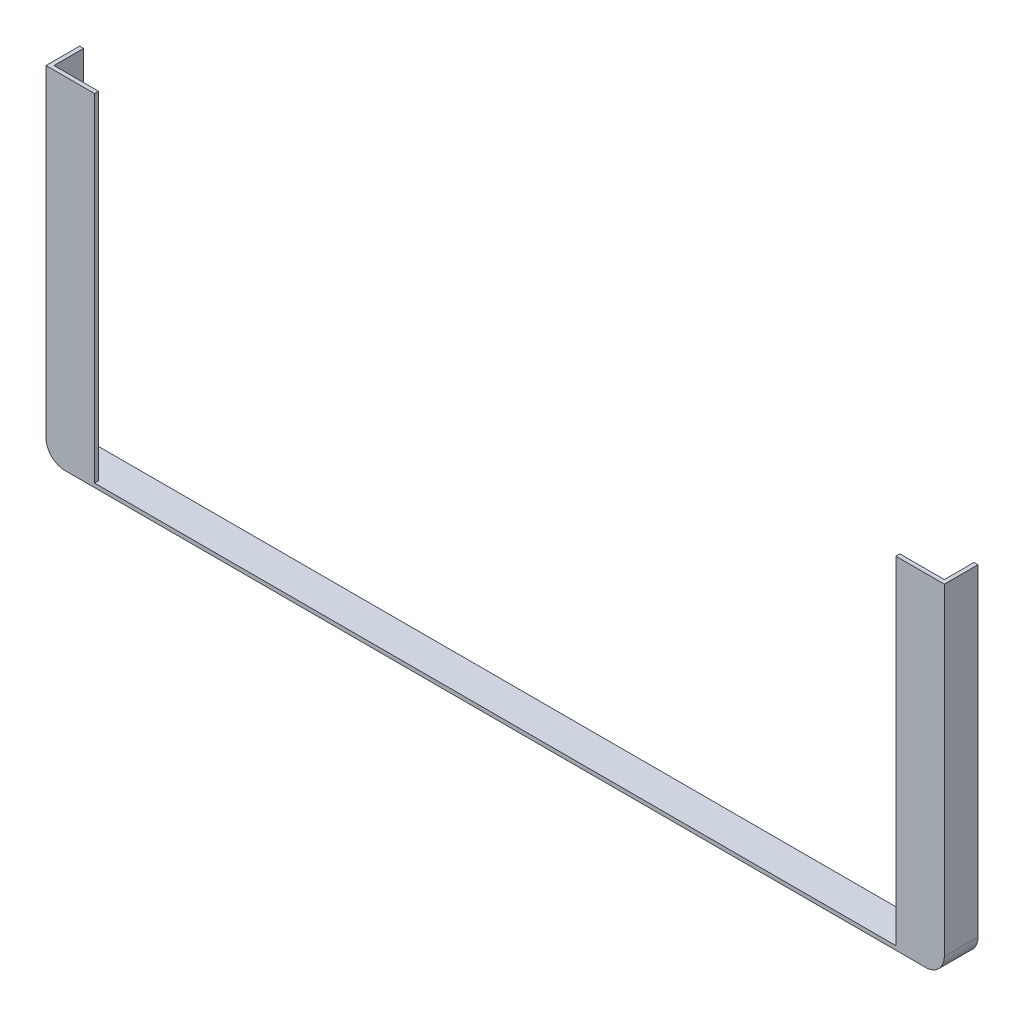
ISO-10303-21;
HEADER;
FILE_DESCRIPTION(('STEP AP214'),'2;1');
FILE_NAME('part.step','',(''),(''),'','','');
FILE_SCHEMA(('AUTOMOTIVE_DESIGN { 1 0 10303 214 1 1 1 1 }'));
ENDSEC;
DATA;
#1=APPLICATION_CONTEXT('core data for automotive mechanical design processes');
#2=APPLICATION_PROTOCOL_DEFINITION('international standard','automotive_design',2000,#1);
#3=PRODUCT_CONTEXT('',#1,'mechanical');
#4=PRODUCT('Part','Part','',(#3));
#5=PRODUCT_RELATED_PRODUCT_CATEGORY('part','',(#4));
#6=PRODUCT_DEFINITION_FORMATION('','',#4);
#7=PRODUCT_DEFINITION_CONTEXT('part definition',#1,'design');
#8=PRODUCT_DEFINITION('design','',#6,#7);
#9=PRODUCT_DEFINITION_SHAPE('','',#8);
#10=(LENGTH_UNIT() NAMED_UNIT(*) SI_UNIT(.MILLI.,.METRE.));
#11=(NAMED_UNIT(*) PLANE_ANGLE_UNIT() SI_UNIT($,.RADIAN.));
#12=(NAMED_UNIT(*) SI_UNIT($,.STERADIAN.) SOLID_ANGLE_UNIT());
#13=UNCERTAINTY_MEASURE_WITH_UNIT(LENGTH_MEASURE(1.E-05),#10,'distance_accuracy_value','');
#14=(GEOMETRIC_REPRESENTATION_CONTEXT(3) GLOBAL_UNCERTAINTY_ASSIGNED_CONTEXT((#13)) GLOBAL_UNIT_ASSIGNED_CONTEXT((#10,
#11,#12)) REPRESENTATION_CONTEXT('',''));
#15=CARTESIAN_POINT('',(0.,0.,0.));
#16=DIRECTION('',(0.,0.,1.));
#17=DIRECTION('',(1.,0.,0.));
#18=AXIS2_PLACEMENT_3D('',#15,#16,#17);
#19=CARTESIAN_POINT('',(381.,288.6837,-25.4));
#20=DIRECTION('',(0.,1.,0.));
#21=DIRECTION('',(0.,0.,1.));
#22=AXIS2_PLACEMENT_3D('',#19,#20,#21);
#23=PLANE('',#22);
#24=DIRECTION('',(0.,0.,-1.));
#25=VECTOR('',#24,1.);
#26=CARTESIAN_POINT('',(342.9,288.6837,3.4173));
#27=LINE('',#26,#25);
#28=CARTESIAN_POINT('',(342.9,288.6837,3.4163));
#29=VERTEX_POINT('',#28);
#30=CARTESIAN_POINT('',(342.9,288.6837,0.));
#31=VERTEX_POINT('',#30);
#32=EDGE_CURVE('E312',#29,#31,#27,.T.);
#33=ORIENTED_EDGE('',*,*,#32,.F.);
#34=DIRECTION('',(-1.,0.,0.));
#35=VECTOR('',#34,1.);
#36=CARTESIAN_POINT('',(384.4163,288.6837,3.4163));
#37=LINE('',#36,#35);
#38=CARTESIAN_POINT('',(384.4163,288.6837,3.4163));
#39=VERTEX_POINT('',#38);
#40=EDGE_CURVE('E269',#39,#29,#37,.T.);
#41=ORIENTED_EDGE('',*,*,#40,.F.);
#42=DIRECTION('',(0.,0.,1.));
#43=VECTOR('',#42,1.);
#44=CARTESIAN_POINT('',(384.4163,288.6837,-25.4));
#45=LINE('',#44,#43);
#46=CARTESIAN_POINT('',(384.4163,288.6837,-25.4));
#47=VERTEX_POINT('',#46);
#48=EDGE_CURVE('E172',#47,#39,#45,.T.);
#49=ORIENTED_EDGE('',*,*,#48,.F.);
#50=DIRECTION('',(-1.,0.,0.));
#51=VECTOR('',#50,1.);
#52=CARTESIAN_POINT('',(381.,288.6837,-25.4));
#53=LINE('',#52,#51);
#54=CARTESIAN_POINT('',(381.,288.6837,-25.4));
#55=VERTEX_POINT('',#54);
#56=EDGE_CURVE('E142',#47,#55,#53,.T.);
#57=ORIENTED_EDGE('',*,*,#56,.T.);
#58=DIRECTION('',(0.,0.,1.));
#59=VECTOR('',#58,1.);
#60=CARTESIAN_POINT('',(381.,288.6837,-25.4));
#61=LINE('',#60,#59);
#62=CARTESIAN_POINT('',(381.,288.6837,0.));
#63=VERTEX_POINT('',#62);
#64=EDGE_CURVE('E130',#55,#63,#61,.T.);
#65=ORIENTED_EDGE('',*,*,#64,.T.);
#66=DIRECTION('',(-1.,0.,0.));
#67=VECTOR('',#66,1.);
#68=CARTESIAN_POINT('',(384.4163,288.6837,0.));
#69=LINE('',#68,#67);
#70=EDGE_CURVE('E205',#63,#31,#69,.T.);
#71=ORIENTED_EDGE('',*,*,#70,.T.);
#72=EDGE_LOOP('',(#33,#41,#49,#57,#65,#71));
#73=FACE_BOUND('',#72,.T.);
#74=ADVANCED_FACE('F34',(#73),#23,.T.);
#75=CARTESIAN_POINT('',(-368.3,12.7,0.));
#76=DIRECTION('',(0.,0.,1.));
#77=DIRECTION('',(1.,0.,0.));
#78=AXIS2_PLACEMENT_3D('',#75,#76,#77);
#79=PLANE('',#78);
#80=DIRECTION('',(-1.,0.,0.));
#81=VECTOR('',#80,1.);
#82=CARTESIAN_POINT('',(-368.3,0.,0.));
#83=LINE('',#82,#81);
#84=CARTESIAN_POINT('',(368.3,1.35308431126191E-13,0.));
#85=VERTEX_POINT('',#84);
#86=CARTESIAN_POINT('',(342.9,1.35308431126191E-13,0.));
#87=VERTEX_POINT('',#86);
#88=EDGE_CURVE('E190',#85,#87,#83,.T.);
#89=ORIENTED_EDGE('',*,*,#88,.T.);
#90=DIRECTION('',(0.,-1.,0.));
#91=VECTOR('',#90,1.);
#92=CARTESIAN_POINT('',(342.9,1.35308431126191E-13,0.));
#93=LINE('',#92,#91);
#94=EDGE_CURVE('E208',#31,#87,#93,.T.);
#95=ORIENTED_EDGE('',*,*,#94,.F.);
#96=ORIENTED_EDGE('',*,*,#70,.F.);
#97=DIRECTION('',(0.,-1.,0.));
#98=VECTOR('',#97,1.);
#99=CARTESIAN_POINT('',(381.,12.7000000000002,0.));
#100=LINE('',#99,#98);
#101=CARTESIAN_POINT('',(381.,12.7000000000002,0.));
#102=VERTEX_POINT('',#101);
#103=EDGE_CURVE('E159',#63,#102,#100,.T.);
#104=ORIENTED_EDGE('',*,*,#103,.T.);
#105=CARTESIAN_POINT('',(368.3,12.7000000000002,0.));
#106=DIRECTION('',(0.,0.,-1.));
#107=DIRECTION('',(1.,0.,0.));
#108=AXIS2_PLACEMENT_3D('',#105,#106,#107);
#109=CIRCLE('',#108,12.7);
#110=EDGE_CURVE('E125',#102,#85,#109,.T.);
#111=ORIENTED_EDGE('',*,*,#110,.T.);
#112=EDGE_LOOP('',(#89,#95,#96,#104,#111));
#113=FACE_BOUND('',#112,.T.);
#114=ADVANCED_FACE('F202',(#113),#79,.F.);
#115=CARTESIAN_POINT('',(-368.3,12.7,-25.4));
#116=DIRECTION('',(0.,0.,1.));
#117=DIRECTION('',(1.,0.,0.));
#118=AXIS2_PLACEMENT_3D('',#115,#116,#117);
#119=CYLINDRICAL_SURFACE('',#118,12.7);
#120=CARTESIAN_POINT('',(-368.3,12.7,0.));
#121=DIRECTION('',(0.,0.,-1.));
#122=DIRECTION('',(1.,0.,0.));
#123=AXIS2_PLACEMENT_3D('',#120,#121,#122);
#124=CIRCLE('',#123,12.7);
#125=CARTESIAN_POINT('',(-368.3,0.,0.));
#126=VERTEX_POINT('',#125);
#127=CARTESIAN_POINT('',(-381.,12.7,0.));
#128=VERTEX_POINT('',#127);
#129=EDGE_CURVE('E149',#126,#128,#124,.T.);
#130=ORIENTED_EDGE('',*,*,#129,.F.);
#131=DIRECTION('',(0.,0.,1.));
#132=VECTOR('',#131,1.);
#133=CARTESIAN_POINT('',(-368.3,0.,-25.4));
#134=LINE('',#133,#132);
#135=CARTESIAN_POINT('',(-368.3,0.,-25.4));
#136=VERTEX_POINT('',#135);
#137=EDGE_CURVE('E11',#136,#126,#134,.T.);
#138=ORIENTED_EDGE('',*,*,#137,.F.);
#139=CARTESIAN_POINT('',(-368.3,12.7,-25.4));
#140=DIRECTION('',(0.,0.,-1.));
#141=DIRECTION('',(1.,0.,0.));
#142=AXIS2_PLACEMENT_3D('',#139,#140,#141);
#143=CIRCLE('',#142,12.7);
#144=CARTESIAN_POINT('',(-381.,12.7,-25.4));
#145=VERTEX_POINT('',#144);
#146=EDGE_CURVE('E192',#136,#145,#143,.T.);
#147=ORIENTED_EDGE('',*,*,#146,.T.);
#148=DIRECTION('',(0.,0.,1.));
#149=VECTOR('',#148,1.);
#150=CARTESIAN_POINT('',(-381.,12.7,-25.4));
#151=LINE('',#150,#149);
#152=EDGE_CURVE('E91',#145,#128,#151,.T.);
#153=ORIENTED_EDGE('',*,*,#152,.T.);
#154=EDGE_LOOP('',(#130,#138,#147,#153));
#155=FACE_BOUND('',#154,.T.);
#156=ADVANCED_FACE('F36',(#155),#119,.F.);
#157=CARTESIAN_POINT('',(-368.3,0.,-25.4));
#158=DIRECTION('',(0.,1.,0.));
#159=DIRECTION('',(-1.,0.,0.));
#160=AXIS2_PLACEMENT_3D('',#157,#158,#159);
#161=PLANE('',#160);
#162=ORIENTED_EDGE('',*,*,#88,.F.);
#163=DIRECTION('',(0.,0.,1.));
#164=VECTOR('',#163,1.);
#165=CARTESIAN_POINT('',(368.3,1.35308431126191E-13,-25.4));
#166=LINE('',#165,#164);
#167=CARTESIAN_POINT('',(368.3,1.35308431126191E-13,-25.4));
#168=VERTEX_POINT('',#167);
#169=EDGE_CURVE('E44',#168,#85,#166,.T.);
#170=ORIENTED_EDGE('',*,*,#169,.F.);
#171=DIRECTION('',(-1.,0.,0.));
#172=VECTOR('',#171,1.);
#173=CARTESIAN_POINT('',(-368.3,0.,-25.4));
#174=LINE('',#173,#172);
#175=EDGE_CURVE('E139',#168,#136,#174,.T.);
#176=ORIENTED_EDGE('',*,*,#175,.T.);
#177=ORIENTED_EDGE('',*,*,#137,.T.);
#178=CARTESIAN_POINT('',(-342.9,1.35308431126191E-13,0.));
#179=VERTEX_POINT('',#178);
#180=EDGE_CURVE('E193',#179,#126,#83,.T.);
#181=ORIENTED_EDGE('',*,*,#180,.F.);
#182=DIRECTION('',(0.,0.,-1.));
#183=VECTOR('',#182,1.);
#184=CARTESIAN_POINT('',(-342.9,1.35308431126191E-13,3.4173));
#185=LINE('',#184,#183);
#186=CARTESIAN_POINT('',(-342.9,1.35308431126191E-13,3.4163));
#187=VERTEX_POINT('',#186);
#188=EDGE_CURVE('E52',#187,#179,#185,.T.);
#189=ORIENTED_EDGE('',*,*,#188,.F.);
#190=DIRECTION('',(-1.,0.,0.));
#191=VECTOR('',#190,1.);
#192=CARTESIAN_POINT('',(342.9,1.35308431126191E-13,3.4163));
#193=LINE('',#192,#191);
#194=CARTESIAN_POINT('',(342.9,1.35308431126191E-13,3.4163));
#195=VERTEX_POINT('',#194);
#196=EDGE_CURVE('E216',#195,#187,#193,.T.);
#197=ORIENTED_EDGE('',*,*,#196,.F.);
#198=DIRECTION('',(0.,0.,-1.));
#199=VECTOR('',#198,1.);
#200=CARTESIAN_POINT('',(342.9,1.35308431126191E-13,3.4173));
#201=LINE('',#200,#199);
#202=EDGE_CURVE('E313',#195,#87,#201,.T.);
#203=ORIENTED_EDGE('',*,*,#202,.T.);
#204=EDGE_LOOP('',(#162,#170,#176,#177,#181,#189,#197,#203));
#205=FACE_BOUND('',#204,.T.);
#206=ADVANCED_FACE('F332',(#205),#161,.T.);
#207=CARTESIAN_POINT('',(368.3,12.7000000000002,-25.4));
#208=DIRECTION('',(0.,0.,1.));
#209=DIRECTION('',(1.,0.,0.));
#210=AXIS2_PLACEMENT_3D('',#207,#208,#209);
#211=CYLINDRICAL_SURFACE('',#210,12.7);
#212=ORIENTED_EDGE('',*,*,#110,.F.);
#213=DIRECTION('',(0.,0.,1.));
#214=VECTOR('',#213,1.);
#215=CARTESIAN_POINT('',(381.,12.7000000000002,-25.4));
#216=LINE('',#215,#214);
#217=CARTESIAN_POINT('',(381.,12.7000000000002,-25.4));
#218=VERTEX_POINT('',#217);
#219=EDGE_CURVE('E119',#218,#102,#216,.T.);
#220=ORIENTED_EDGE('',*,*,#219,.F.);
#221=CARTESIAN_POINT('',(368.3,12.7000000000002,-25.4));
#222=DIRECTION('',(0.,0.,-1.));
#223=DIRECTION('',(1.,0.,0.));
#224=AXIS2_PLACEMENT_3D('',#221,#222,#223);
#225=CIRCLE('',#224,12.7);
#226=EDGE_CURVE('E122',#218,#168,#225,.T.);
#227=ORIENTED_EDGE('',*,*,#226,.T.);
#228=ORIENTED_EDGE('',*,*,#169,.T.);
#229=EDGE_LOOP('',(#212,#220,#227,#228));
#230=FACE_BOUND('',#229,.T.);
#231=ADVANCED_FACE('F121',(#230),#211,.F.);
#232=CARTESIAN_POINT('',(381.,12.7000000000002,-25.4));
#233=DIRECTION('',(-1.,0.,0.));
#234=DIRECTION('',(0.,-1.,0.));
#235=AXIS2_PLACEMENT_3D('',#232,#233,#234);
#236=PLANE('',#235);
#237=ORIENTED_EDGE('',*,*,#103,.F.);
#238=ORIENTED_EDGE('',*,*,#64,.F.);
#239=DIRECTION('',(0.,-1.,0.));
#240=VECTOR('',#239,1.);
#241=CARTESIAN_POINT('',(381.,12.7000000000002,-25.4));
#242=LINE('',#241,#240);
#243=EDGE_CURVE('E136',#55,#218,#242,.T.);
#244=ORIENTED_EDGE('',*,*,#243,.T.);
#245=ORIENTED_EDGE('',*,*,#219,.T.);
#246=EDGE_LOOP('',(#237,#238,#244,#245));
#247=FACE_BOUND('',#246,.T.);
#248=ADVANCED_FACE('F141',(#247),#236,.T.);
#249=DIRECTION('',(0.,0.,-1.));
#250=VECTOR('',#249,1.);
#251=CARTESIAN_POINT('',(-342.9,288.6837,3.4173));
#252=LINE('',#251,#250);
#253=CARTESIAN_POINT('',(-342.9,288.6837,3.4163));
#254=VERTEX_POINT('',#253);
#255=CARTESIAN_POINT('',(-342.9,288.6837,0.));
#256=VERTEX_POINT('',#255);
#257=EDGE_CURVE('E318',#254,#256,#252,.T.);
#258=ORIENTED_EDGE('',*,*,#257,.T.);
#259=CARTESIAN_POINT('',(-381.,288.6837,0.));
#260=VERTEX_POINT('',#259);
#261=EDGE_CURVE('E38',#256,#260,#69,.T.);
#262=ORIENTED_EDGE('',*,*,#261,.T.);
#263=DIRECTION('',(0.,0.,1.));
#264=VECTOR('',#263,1.);
#265=CARTESIAN_POINT('',(-381.,288.6837,-25.4));
#266=LINE('',#265,#264);
#267=CARTESIAN_POINT('',(-381.,288.6837,-25.4));
#268=VERTEX_POINT('',#267);
#269=EDGE_CURVE('E162',#268,#260,#266,.T.);
#270=ORIENTED_EDGE('',*,*,#269,.F.);
#271=DIRECTION('',(-1.,0.,0.));
#272=VECTOR('',#271,1.);
#273=CARTESIAN_POINT('',(-384.4163,288.6837,-25.4));
#274=LINE('',#273,#272);
#275=CARTESIAN_POINT('',(-384.4163,288.6837,-25.4));
#276=VERTEX_POINT('',#275);
#277=EDGE_CURVE('E221',#268,#276,#274,.T.);
#278=ORIENTED_EDGE('',*,*,#277,.T.);
#279=DIRECTION('',(0.,0.,1.));
#280=VECTOR('',#279,1.);
#281=CARTESIAN_POINT('',(-384.4163,288.6837,-25.4));
#282=LINE('',#281,#280);
#283=CARTESIAN_POINT('',(-384.4163,288.6837,3.4163));
#284=VERTEX_POINT('',#283);
#285=EDGE_CURVE('E165',#276,#284,#282,.T.);
#286=ORIENTED_EDGE('',*,*,#285,.T.);
#287=EDGE_CURVE('E268',#254,#284,#37,.T.);
#288=ORIENTED_EDGE('',*,*,#287,.F.);
#289=EDGE_LOOP('',(#258,#262,#270,#278,#286,#288));
#290=FACE_BOUND('',#289,.T.);
#291=ADVANCED_FACE('F287',(#290),#23,.T.);
#292=CARTESIAN_POINT('',(384.4163,12.7000000000002,-25.4));
#293=DIRECTION('',(1.,0.,0.));
#294=DIRECTION('',(0.,0.,-1.));
#295=AXIS2_PLACEMENT_3D('',#292,#293,#294);
#296=PLANE('',#295);
#297=ORIENTED_EDGE('',*,*,#48,.T.);
#298=DIRECTION('',(0.,1.,0.));
#299=VECTOR('',#298,1.);
#300=CARTESIAN_POINT('',(384.4163,12.7000000000002,3.4163));
#301=LINE('',#300,#299);
#302=CARTESIAN_POINT('',(384.4163,12.7000000000002,3.4163));
#303=VERTEX_POINT('',#302);
#304=EDGE_CURVE('E263',#303,#39,#301,.T.);
#305=ORIENTED_EDGE('',*,*,#304,.F.);
#306=DIRECTION('',(0.,0.,1.));
#307=VECTOR('',#306,1.);
#308=CARTESIAN_POINT('',(384.4163,12.7000000000002,-25.4));
#309=LINE('',#308,#307);
#310=CARTESIAN_POINT('',(384.4163,12.7000000000002,-25.4));
#311=VERTEX_POINT('',#310);
#312=EDGE_CURVE('E185',#311,#303,#309,.T.);
#313=ORIENTED_EDGE('',*,*,#312,.F.);
#314=DIRECTION('',(0.,1.,0.));
#315=VECTOR('',#314,1.);
#316=CARTESIAN_POINT('',(384.4163,12.7000000000002,-25.4));
#317=LINE('',#316,#315);
#318=EDGE_CURVE('E144',#311,#47,#317,.T.);
#319=ORIENTED_EDGE('',*,*,#318,.T.);
#320=EDGE_LOOP('',(#297,#305,#313,#319));
#321=FACE_BOUND('',#320,.T.);
#322=ADVANCED_FACE('F238',(#321),#296,.T.);
#323=CARTESIAN_POINT('',(368.3,12.7000000000002,-25.4));
#324=DIRECTION('',(0.,0.,1.));
#325=DIRECTION('',(1.,0.,0.));
#326=AXIS2_PLACEMENT_3D('',#323,#324,#325);
#327=CYLINDRICAL_SURFACE('',#326,16.1163);
#328=ORIENTED_EDGE('',*,*,#312,.T.);
#329=CARTESIAN_POINT('',(368.3,12.7000000000002,3.4163));
#330=DIRECTION('',(0.,0.,1.));
#331=DIRECTION('',(1.,0.,0.));
#332=AXIS2_PLACEMENT_3D('',#329,#330,#331);
#333=CIRCLE('',#332,16.1163);
#334=CARTESIAN_POINT('',(368.3,-3.41629999999987,3.4163));
#335=VERTEX_POINT('',#334);
#336=EDGE_CURVE('E250',#335,#303,#333,.T.);
#337=ORIENTED_EDGE('',*,*,#336,.F.);
#338=DIRECTION('',(0.,0.,1.));
#339=VECTOR('',#338,1.);
#340=CARTESIAN_POINT('',(368.3,-3.41629999999987,-25.4));
#341=LINE('',#340,#339);
#342=CARTESIAN_POINT('',(368.3,-3.41629999999987,-25.4));
#343=VERTEX_POINT('',#342);
#344=EDGE_CURVE('E182',#343,#335,#341,.T.);
#345=ORIENTED_EDGE('',*,*,#344,.F.);
#346=CARTESIAN_POINT('',(368.3,12.7000000000002,-25.4));
#347=DIRECTION('',(0.,0.,1.));
#348=DIRECTION('',(1.,0.,0.));
#349=AXIS2_PLACEMENT_3D('',#346,#347,#348);
#350=CIRCLE('',#349,16.1163);
#351=EDGE_CURVE('E233',#343,#311,#350,.T.);
#352=ORIENTED_EDGE('',*,*,#351,.T.);
#353=EDGE_LOOP('',(#328,#337,#345,#352));
#354=FACE_BOUND('',#353,.T.);
#355=ADVANCED_FACE('F245',(#354),#327,.T.);
#356=CARTESIAN_POINT('',(-368.3,-3.4163,-25.4));
#357=DIRECTION('',(0.,-1.,0.));
#358=DIRECTION('',(1.,0.,0.));
#359=AXIS2_PLACEMENT_3D('',#356,#357,#358);
#360=PLANE('',#359);
#361=ORIENTED_EDGE('',*,*,#344,.T.);
#362=DIRECTION('',(1.,0.,0.));
#363=VECTOR('',#362,1.);
#364=CARTESIAN_POINT('',(-368.3,-3.41629999999999,3.4163));
#365=LINE('',#364,#363);
#366=CARTESIAN_POINT('',(-368.3,-3.41629999999999,3.4163));
#367=VERTEX_POINT('',#366);
#368=EDGE_CURVE('E214',#367,#335,#365,.T.);
#369=ORIENTED_EDGE('',*,*,#368,.F.);
#370=DIRECTION('',(0.,0.,1.));
#371=VECTOR('',#370,1.);
#372=CARTESIAN_POINT('',(-368.3,-3.41629999999999,-25.4));
#373=LINE('',#372,#371);
#374=CARTESIAN_POINT('',(-368.3,-3.41629999999999,-25.4));
#375=VERTEX_POINT('',#374);
#376=EDGE_CURVE('E179',#375,#367,#373,.T.);
#377=ORIENTED_EDGE('',*,*,#376,.F.);
#378=DIRECTION('',(1.,0.,0.));
#379=VECTOR('',#378,1.);
#380=CARTESIAN_POINT('',(-368.3,-3.4163,-25.4));
#381=LINE('',#380,#379);
#382=EDGE_CURVE('E230',#375,#343,#381,.T.);
#383=ORIENTED_EDGE('',*,*,#382,.T.);
#384=EDGE_LOOP('',(#361,#369,#377,#383));
#385=FACE_BOUND('',#384,.T.);
#386=ADVANCED_FACE('F254',(#385),#360,.T.);
#387=CARTESIAN_POINT('',(-368.3,12.7,-25.4));
#388=DIRECTION('',(0.,0.,1.));
#389=DIRECTION('',(1.,0.,0.));
#390=AXIS2_PLACEMENT_3D('',#387,#388,#389);
#391=CYLINDRICAL_SURFACE('',#390,16.1163);
#392=ORIENTED_EDGE('',*,*,#376,.T.);
#393=CARTESIAN_POINT('',(-368.3,12.7,3.4163));
#394=DIRECTION('',(0.,0.,1.));
#395=DIRECTION('',(1.,0.,0.));
#396=AXIS2_PLACEMENT_3D('',#393,#394,#395);
#397=CIRCLE('',#396,16.1163);
#398=CARTESIAN_POINT('',(-384.4163,12.7,3.4163));
#399=VERTEX_POINT('',#398);
#400=EDGE_CURVE('E211',#399,#367,#397,.T.);
#401=ORIENTED_EDGE('',*,*,#400,.F.);
#402=DIRECTION('',(0.,0.,1.));
#403=VECTOR('',#402,1.);
#404=CARTESIAN_POINT('',(-384.4163,12.7,-25.4));
#405=LINE('',#404,#403);
#406=CARTESIAN_POINT('',(-384.4163,12.7,-25.4));
#407=VERTEX_POINT('',#406);
#408=EDGE_CURVE('E176',#407,#399,#405,.T.);
#409=ORIENTED_EDGE('',*,*,#408,.F.);
#410=CARTESIAN_POINT('',(-368.3,12.7,-25.4));
#411=DIRECTION('',(0.,0.,1.));
#412=DIRECTION('',(1.,0.,0.));
#413=AXIS2_PLACEMENT_3D('',#410,#411,#412);
#414=CIRCLE('',#413,16.1163);
#415=EDGE_CURVE('E227',#407,#375,#414,.T.);
#416=ORIENTED_EDGE('',*,*,#415,.T.);
#417=EDGE_LOOP('',(#392,#401,#409,#416));
#418=FACE_BOUND('',#417,.T.);
#419=ADVANCED_FACE('F279',(#418),#391,.T.);
#420=CARTESIAN_POINT('',(-384.4163,12.7,-25.4));
#421=DIRECTION('',(-1.,0.,0.));
#422=DIRECTION('',(0.,0.,1.));
#423=AXIS2_PLACEMENT_3D('',#420,#421,#422);
#424=PLANE('',#423);
#425=ORIENTED_EDGE('',*,*,#408,.T.);
#426=DIRECTION('',(0.,-1.,0.));
#427=VECTOR('',#426,1.);
#428=CARTESIAN_POINT('',(-384.4163,288.6837,3.4163));
#429=LINE('',#428,#427);
#430=EDGE_CURVE('E153',#284,#399,#429,.T.);
#431=ORIENTED_EDGE('',*,*,#430,.F.);
#432=ORIENTED_EDGE('',*,*,#285,.F.);
#433=DIRECTION('',(0.,-1.,0.));
#434=VECTOR('',#433,1.);
#435=CARTESIAN_POINT('',(-384.4163,12.7,-25.4));
#436=LINE('',#435,#434);
#437=EDGE_CURVE('E224',#276,#407,#436,.T.);
#438=ORIENTED_EDGE('',*,*,#437,.T.);
#439=EDGE_LOOP('',(#425,#431,#432,#438));
#440=FACE_BOUND('',#439,.T.);
#441=ADVANCED_FACE('F284',(#440),#424,.T.);
#442=CARTESIAN_POINT('',(-381.,12.7,-25.4));
#443=DIRECTION('',(1.,0.,0.));
#444=DIRECTION('',(0.,0.,-1.));
#445=AXIS2_PLACEMENT_3D('',#442,#443,#444);
#446=PLANE('',#445);
#447=DIRECTION('',(0.,1.,0.));
#448=VECTOR('',#447,1.);
#449=CARTESIAN_POINT('',(-381.,12.7,0.));
#450=LINE('',#449,#448);
#451=EDGE_CURVE('E152',#128,#260,#450,.T.);
#452=ORIENTED_EDGE('',*,*,#451,.F.);
#453=ORIENTED_EDGE('',*,*,#152,.F.);
#454=DIRECTION('',(0.,1.,0.));
#455=VECTOR('',#454,1.);
#456=CARTESIAN_POINT('',(-381.,12.7,-25.4));
#457=LINE('',#456,#455);
#458=EDGE_CURVE('E197',#145,#268,#457,.T.);
#459=ORIENTED_EDGE('',*,*,#458,.T.);
#460=ORIENTED_EDGE('',*,*,#269,.T.);
#461=EDGE_LOOP('',(#452,#453,#459,#460));
#462=FACE_BOUND('',#461,.T.);
#463=ADVANCED_FACE('F331',(#462),#446,.T.);
#464=CARTESIAN_POINT('',(-368.3,12.7,-25.4));
#465=DIRECTION('',(0.,0.,1.));
#466=DIRECTION('',(1.,0.,0.));
#467=AXIS2_PLACEMENT_3D('',#464,#465,#466);
#468=PLANE('',#467);
#469=ORIENTED_EDGE('',*,*,#146,.F.);
#470=ORIENTED_EDGE('',*,*,#175,.F.);
#471=ORIENTED_EDGE('',*,*,#226,.F.);
#472=ORIENTED_EDGE('',*,*,#243,.F.);
#473=ORIENTED_EDGE('',*,*,#56,.F.);
#474=ORIENTED_EDGE('',*,*,#318,.F.);
#475=ORIENTED_EDGE('',*,*,#351,.F.);
#476=ORIENTED_EDGE('',*,*,#382,.F.);
#477=ORIENTED_EDGE('',*,*,#415,.F.);
#478=ORIENTED_EDGE('',*,*,#437,.F.);
#479=ORIENTED_EDGE('',*,*,#277,.F.);
#480=ORIENTED_EDGE('',*,*,#458,.F.);
#481=EDGE_LOOP('',(#469,#470,#471,#472,#473,#474,#475,#476,#477,#478,#479,#480));
#482=FACE_BOUND('',#481,.T.);
#483=ADVANCED_FACE('F134',(#482),#468,.F.);
#484=ORIENTED_EDGE('',*,*,#261,.F.);
#485=DIRECTION('',(0.,1.,0.));
#486=VECTOR('',#485,1.);
#487=CARTESIAN_POINT('',(-342.9,1.35308431126191E-13,0.));
#488=LINE('',#487,#486);
#489=EDGE_CURVE('E322',#179,#256,#488,.T.);
#490=ORIENTED_EDGE('',*,*,#489,.F.);
#491=ORIENTED_EDGE('',*,*,#180,.T.);
#492=ORIENTED_EDGE('',*,*,#129,.T.);
#493=ORIENTED_EDGE('',*,*,#451,.T.);
#494=EDGE_LOOP('',(#484,#490,#491,#492,#493));
#495=FACE_BOUND('',#494,.T.);
#496=ADVANCED_FACE('F330',(#495),#79,.F.);
#497=CARTESIAN_POINT('',(-368.3,12.7,3.4163));
#498=DIRECTION('',(0.,0.,1.));
#499=DIRECTION('',(1.,0.,0.));
#500=AXIS2_PLACEMENT_3D('',#497,#498,#499);
#501=PLANE('',#500);
#502=DIRECTION('',(0.,-1.,0.));
#503=VECTOR('',#502,1.);
#504=CARTESIAN_POINT('',(342.9,1.35308431126191E-13,3.4163));
#505=LINE('',#504,#503);
#506=EDGE_CURVE('E310',#29,#195,#505,.T.);
#507=ORIENTED_EDGE('',*,*,#506,.T.);
#508=ORIENTED_EDGE('',*,*,#196,.T.);
#509=DIRECTION('',(0.,1.,0.));
#510=VECTOR('',#509,1.);
#511=CARTESIAN_POINT('',(-342.9,1.35308431126191E-13,3.4163));
#512=LINE('',#511,#510);
#513=EDGE_CURVE('E315',#187,#254,#512,.T.);
#514=ORIENTED_EDGE('',*,*,#513,.T.);
#515=ORIENTED_EDGE('',*,*,#287,.T.);
#516=ORIENTED_EDGE('',*,*,#430,.T.);
#517=ORIENTED_EDGE('',*,*,#400,.T.);
#518=ORIENTED_EDGE('',*,*,#368,.T.);
#519=ORIENTED_EDGE('',*,*,#336,.T.);
#520=ORIENTED_EDGE('',*,*,#304,.T.);
#521=ORIENTED_EDGE('',*,*,#40,.T.);
#522=EDGE_LOOP('',(#507,#508,#514,#515,#516,#517,#518,#519,#520,#521));
#523=FACE_BOUND('',#522,.T.);
#524=ADVANCED_FACE('F259',(#523),#501,.T.);
#525=CARTESIAN_POINT('',(342.9,1.35308431126191E-13,3.4173));
#526=DIRECTION('',(1.,0.,0.));
#527=DIRECTION('',(0.,0.,-1.));
#528=AXIS2_PLACEMENT_3D('',#525,#526,#527);
#529=PLANE('',#528);
#530=ORIENTED_EDGE('',*,*,#32,.T.);
#531=ORIENTED_EDGE('',*,*,#94,.T.);
#532=ORIENTED_EDGE('',*,*,#202,.F.);
#533=ORIENTED_EDGE('',*,*,#506,.F.);
#534=EDGE_LOOP('',(#530,#531,#532,#533));
#535=FACE_BOUND('',#534,.T.);
#536=ADVANCED_FACE('F311',(#535),#529,.F.);
#537=CARTESIAN_POINT('',(-342.9,1.35308431126191E-13,3.4173));
#538=DIRECTION('',(-1.,0.,0.));
#539=DIRECTION('',(0.,0.,1.));
#540=AXIS2_PLACEMENT_3D('',#537,#538,#539);
#541=PLANE('',#540);
#542=ORIENTED_EDGE('',*,*,#188,.T.);
#543=ORIENTED_EDGE('',*,*,#489,.T.);
#544=ORIENTED_EDGE('',*,*,#257,.F.);
#545=ORIENTED_EDGE('',*,*,#513,.F.);
#546=EDGE_LOOP('',(#542,#543,#544,#545));
#547=FACE_BOUND('',#546,.T.);
#548=ADVANCED_FACE('F328',(#547),#541,.F.);
#549=CLOSED_SHELL('',(#74,#114,#156,#206,#231,#248,#291,#322,#355,#386,#419,#441,#463,#483,#496,
#524,#536,#548));
#550=MANIFOLD_SOLID_BREP('B2',#549);
#551=ADVANCED_BREP_SHAPE_REPRESENTATION('',(#18,#550),#14);
#552=SHAPE_DEFINITION_REPRESENTATION(#9,#551);
ENDSEC;
END-ISO-10303-21;
